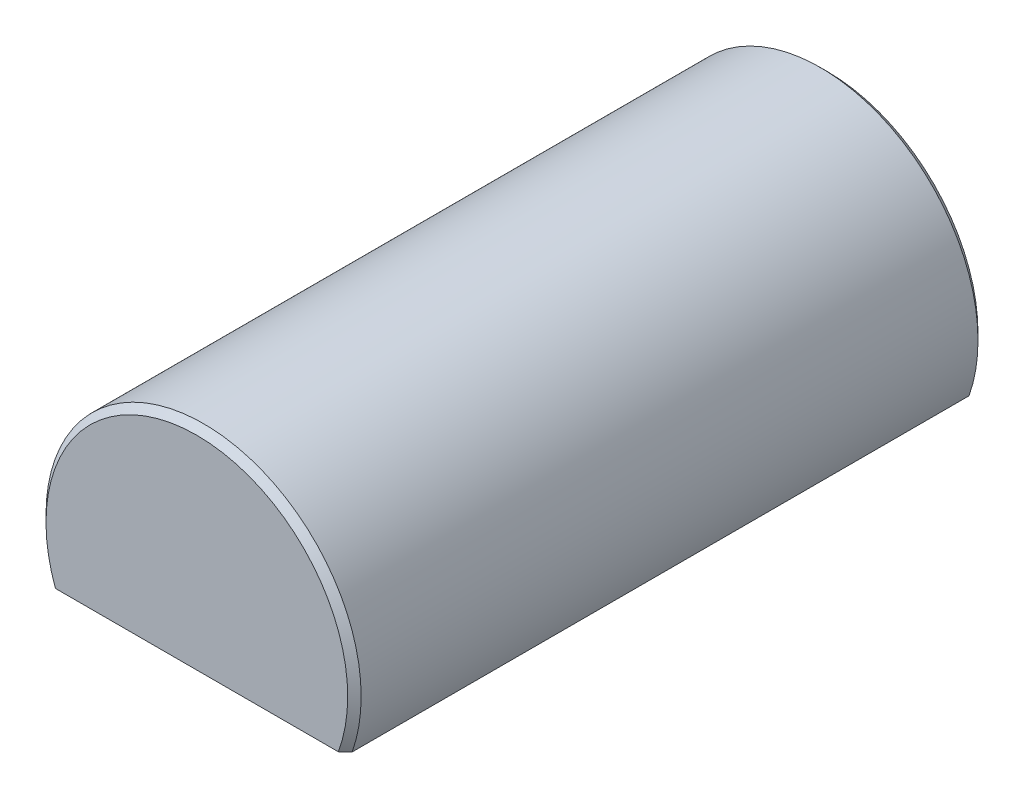
ISO-10303-21;
HEADER;
FILE_DESCRIPTION(('STEP AP214'),'2;1');
FILE_NAME('part.step','',(''),(''),'','','');
FILE_SCHEMA(('AUTOMOTIVE_DESIGN { 1 0 10303 214 1 1 1 1 }'));
ENDSEC;
DATA;
#1=APPLICATION_CONTEXT('core data for automotive mechanical design processes');
#2=APPLICATION_PROTOCOL_DEFINITION('international standard','automotive_design',2000,#1);
#3=PRODUCT_CONTEXT('',#1,'mechanical');
#4=PRODUCT('Part','Part','',(#3));
#5=PRODUCT_RELATED_PRODUCT_CATEGORY('part','',(#4));
#6=PRODUCT_DEFINITION_FORMATION('','',#4);
#7=PRODUCT_DEFINITION_CONTEXT('part definition',#1,'design');
#8=PRODUCT_DEFINITION('design','',#6,#7);
#9=PRODUCT_DEFINITION_SHAPE('','',#8);
#10=(LENGTH_UNIT() NAMED_UNIT(*) SI_UNIT(.MILLI.,.METRE.));
#11=(NAMED_UNIT(*) PLANE_ANGLE_UNIT() SI_UNIT($,.RADIAN.));
#12=(NAMED_UNIT(*) SI_UNIT($,.STERADIAN.) SOLID_ANGLE_UNIT());
#13=UNCERTAINTY_MEASURE_WITH_UNIT(LENGTH_MEASURE(1.E-05),#10,'distance_accuracy_value','');
#14=(GEOMETRIC_REPRESENTATION_CONTEXT(3) GLOBAL_UNCERTAINTY_ASSIGNED_CONTEXT((#13)) GLOBAL_UNIT_ASSIGNED_CONTEXT((#10,
#11,#12)) REPRESENTATION_CONTEXT('',''));
#15=CARTESIAN_POINT('',(0.,0.,0.));
#16=DIRECTION('',(0.,0.,1.));
#17=DIRECTION('',(1.,0.,0.));
#18=AXIS2_PLACEMENT_3D('',#15,#16,#17);
#19=CARTESIAN_POINT('',(0.,0.,19.05));
#20=DIRECTION('',(0.,0.,-1.));
#21=DIRECTION('',(-1.,0.,0.));
#22=AXIS2_PLACEMENT_3D('',#19,#20,#21);
#23=CYLINDRICAL_SURFACE('',#22,9.525);
#24=CARTESIAN_POINT('',(0.,0.,18.6436));
#25=DIRECTION('',(0.,0.,1.));
#26=DIRECTION('',(1.,0.,0.));
#27=AXIS2_PLACEMENT_3D('',#24,#25,#26);
#28=CIRCLE('',#27,9.525);
#29=CARTESIAN_POINT('',(-8.98025612106915,-3.175,18.6436));
#30=VERTEX_POINT('',#29);
#31=CARTESIAN_POINT('',(8.98025612106915,-3.175,18.6436));
#32=VERTEX_POINT('',#31);
#33=EDGE_CURVE('E106',#30,#32,#28,.F.);
#34=ORIENTED_EDGE('',*,*,#33,.T.);
#35=DIRECTION('',(0.,0.,1.));
#36=VECTOR('',#35,1.);
#37=CARTESIAN_POINT('',(8.98025612106915,-3.175,-19.05));
#38=LINE('',#37,#36);
#39=CARTESIAN_POINT('',(8.98025612106915,-3.175,-18.6435999999999));
#40=VERTEX_POINT('',#39);
#41=EDGE_CURVE('E88',#40,#32,#38,.T.);
#42=ORIENTED_EDGE('',*,*,#41,.F.);
#43=CARTESIAN_POINT('',(0.,0.,-18.6435999999999));
#44=DIRECTION('',(0.,0.,1.));
#45=DIRECTION('',(1.,0.,0.));
#46=AXIS2_PLACEMENT_3D('',#43,#44,#45);
#47=CIRCLE('',#46,9.525);
#48=CARTESIAN_POINT('',(-8.98025612106915,-3.175,-18.6435999999999));
#49=VERTEX_POINT('',#48);
#50=EDGE_CURVE('E101',#40,#49,#47,.T.);
#51=ORIENTED_EDGE('',*,*,#50,.T.);
#52=DIRECTION('',(0.,0.,1.));
#53=VECTOR('',#52,1.);
#54=CARTESIAN_POINT('',(-8.98025612106915,-3.175,-19.05));
#55=LINE('',#54,#53);
#56=EDGE_CURVE('E113',#49,#30,#55,.T.);
#57=ORIENTED_EDGE('',*,*,#56,.T.);
#58=EDGE_LOOP('',(#34,#42,#51,#57));
#59=FACE_BOUND('',#58,.T.);
#60=ADVANCED_FACE('F44',(#59),#23,.T.);
#61=CARTESIAN_POINT('',(0.,0.,19.05));
#62=DIRECTION('',(0.,0.,1.));
#63=DIRECTION('',(1.,0.,0.));
#64=AXIS2_PLACEMENT_3D('',#61,#62,#63);
#65=PLANE('',#64);
#66=DIRECTION('',(-1.,0.,0.));
#67=VECTOR('',#66,1.);
#68=CARTESIAN_POINT('',(-8.98025612106915,-3.175,19.05));
#69=LINE('',#68,#67);
#70=CARTESIAN_POINT('',(8.54799631258698,-3.175,19.05));
#71=VERTEX_POINT('',#70);
#72=CARTESIAN_POINT('',(-8.54799631258698,-3.175,19.05));
#73=VERTEX_POINT('',#72);
#74=EDGE_CURVE('E63',#71,#73,#69,.T.);
#75=ORIENTED_EDGE('',*,*,#74,.F.);
#76=CARTESIAN_POINT('',(0.,0.,19.05));
#77=DIRECTION('',(0.,0.,1.));
#78=DIRECTION('',(1.,0.,0.));
#79=AXIS2_PLACEMENT_3D('',#76,#77,#78);
#80=CIRCLE('',#79,9.11860000000003);
#81=EDGE_CURVE('E96',#71,#73,#80,.T.);
#82=ORIENTED_EDGE('',*,*,#81,.T.);
#83=EDGE_LOOP('',(#75,#82));
#84=FACE_BOUND('',#83,.T.);
#85=ADVANCED_FACE('F95',(#84),#65,.T.);
#86=CARTESIAN_POINT('',(0.,0.,-19.05));
#87=DIRECTION('',(0.,0.,1.));
#88=DIRECTION('',(1.,0.,0.));
#89=AXIS2_PLACEMENT_3D('',#86,#87,#88);
#90=PLANE('',#89);
#91=CARTESIAN_POINT('',(0.,0.,-19.05));
#92=DIRECTION('',(0.,0.,1.));
#93=DIRECTION('',(1.,0.,0.));
#94=AXIS2_PLACEMENT_3D('',#91,#92,#93);
#95=CIRCLE('',#94,9.11859999999995);
#96=CARTESIAN_POINT('',(-8.54799631258689,-3.175,-19.05));
#97=VERTEX_POINT('',#96);
#98=CARTESIAN_POINT('',(8.54799631258689,-3.175,-19.05));
#99=VERTEX_POINT('',#98);
#100=EDGE_CURVE('E99',#97,#99,#95,.F.);
#101=ORIENTED_EDGE('',*,*,#100,.T.);
#102=DIRECTION('',(-1.,0.,0.));
#103=VECTOR('',#102,1.);
#104=CARTESIAN_POINT('',(-8.98025612106915,-3.175,-19.05));
#105=LINE('',#104,#103);
#106=EDGE_CURVE('E97',#99,#97,#105,.T.);
#107=ORIENTED_EDGE('',*,*,#106,.T.);
#108=EDGE_LOOP('',(#101,#107));
#109=FACE_BOUND('',#108,.T.);
#110=ADVANCED_FACE('F124',(#109),#90,.F.);
#111=CARTESIAN_POINT('',(0.,0.,-18.6435999999999));
#112=DIRECTION('',(0.,0.,1.));
#113=DIRECTION('',(1.,0.,0.));
#114=AXIS2_PLACEMENT_3D('',#111,#112,#113);
#115=CONICAL_SURFACE('',#114,9.525,0.78539816339744);
#116=CARTESIAN_POINT('',(-19.7595218480049,-3.175,-8.15562099481962));
#117=CARTESIAN_POINT('',(-19.1925140216925,-3.175,-8.7154183397015));
#118=CARTESIAN_POINT('',(-18.6252305331766,-3.175,-9.27493723010743));
#119=CARTESIAN_POINT('',(-17.4894657452954,-3.175,-10.3935596725078));
#120=CARTESIAN_POINT('',(-16.9209838832793,-3.175,-10.9526626531448));
#121=CARTESIAN_POINT('',(-15.7755741167121,-3.175,-12.0770696474654));
#122=CARTESIAN_POINT('',(-15.1986325304485,-3.175,-12.6423597290652));
#123=CARTESIAN_POINT('',(-14.0436688072204,-3.175,-13.7710255464829));
#124=CARTESIAN_POINT('',(-13.4656477108254,-3.175,-14.3344023462319));
#125=CARTESIAN_POINT('',(-12.4705159540612,-3.175,-15.3006344002603));
#126=CARTESIAN_POINT('',(-12.0539233816909,-3.175,-15.7040230509635));
#127=CARTESIAN_POINT('',(-11.219222220886,-3.175,-16.5092923897319));
#128=CARTESIAN_POINT('',(-10.8011135222039,-3.175,-16.9111729636285));
#129=CARTESIAN_POINT('',(-9.9618043890059,-3.175,-17.7137894720876));
#130=CARTESIAN_POINT('',(-9.54059885127725,-3.175,-18.1145200738019));
#131=CARTESIAN_POINT('',(-8.69536369274984,-3.175,-18.9127645983045));
#132=CARTESIAN_POINT('',(-8.27133489125373,-3.175,-19.3102793859794));
#133=CARTESIAN_POINT('',(-7.6341707298214,-3.175,-19.9008908184188));
#134=CARTESIAN_POINT('',(-7.42271751985765,-3.175,-20.0958012630927));
#135=CARTESIAN_POINT('',(-6.9984306447158,-3.175,-20.484114250534));
#136=CARTESIAN_POINT('',(-6.78559698276183,-3.175,-20.6775167968209));
#137=CARTESIAN_POINT('',(-6.35793966377378,-3.175,-21.0625925503336));
#138=CARTESIAN_POINT('',(-6.14311406353169,-3.175,-21.254263604613));
#139=CARTESIAN_POINT('',(-5.81916935713243,-3.175,-21.5398164840543));
#140=CARTESIAN_POINT('',(-5.71090790489853,-3.175,-21.6346712877901));
#141=CARTESIAN_POINT('',(-5.49371873101143,-3.175,-21.8236251078582));
#142=CARTESIAN_POINT('',(-5.38479097918381,-3.175,-21.9177240895089));
#143=CARTESIAN_POINT('',(-5.05787462655519,-3.175,-22.197831488485));
#144=CARTESIAN_POINT('',(-4.83875951405758,-3.175,-22.3825297757046));
#145=CARTESIAN_POINT('',(-4.39646847568308,-3.175,-22.7469971377807));
#146=CARTESIAN_POINT('',(-4.17329291837068,-3.175,-22.9267666563422));
#147=CARTESIAN_POINT('',(-3.83443703007303,-3.175,-23.1907907398475));
#148=CARTESIAN_POINT('',(-3.72089777113942,-3.175,-23.2777913468337));
#149=CARTESIAN_POINT('',(-3.49211368943676,-3.175,-23.4495161287082));
#150=CARTESIAN_POINT('',(-3.37686895479638,-3.175,-23.5342404205902));
#151=CARTESIAN_POINT('',(-3.14439364175478,-3.175,-23.7007968775851));
#152=CARTESIAN_POINT('',(-3.02716412294902,-3.175,-23.7826305180934));
#153=CARTESIAN_POINT('',(-2.79025811492881,-3.175,-23.9426648438419));
#154=CARTESIAN_POINT('',(-2.67058203505152,-3.175,-24.0208661297667));
#155=CARTESIAN_POINT('',(-2.5205246375012,-3.175,-24.1148160231544));
#156=CARTESIAN_POINT('',(-2.49152725675288,-3.175,-24.132784639231));
#157=CARTESIAN_POINT('',(-2.43335482916836,-3.175,-24.1684360452421));
#158=CARTESIAN_POINT('',(-2.4041797718255,-3.175,-24.1861188180433));
#159=CARTESIAN_POINT('',(-2.31637282554547,-3.175,-24.2387132160758));
#160=CARTESIAN_POINT('',(-2.25746552490126,-3.175,-24.2731669271138));
#161=CARTESIAN_POINT('',(-2.13884991633875,-3.175,-24.3406860355773));
#162=CARTESIAN_POINT('',(-2.07914152230363,-3.175,-24.3737512821406));
#163=CARTESIAN_POINT('',(-1.9588719702749,-3.175,-24.4382873931208));
#164=CARTESIAN_POINT('',(-1.89831082667793,-3.175,-24.4697582844134));
#165=CARTESIAN_POINT('',(-1.71626949487602,-3.175,-24.5609395675323));
#166=CARTESIAN_POINT('',(-1.59343488727859,-3.175,-24.6179939551702));
#167=CARTESIAN_POINT('',(-1.3438126804564,-3.175,-24.7227838688997));
#168=CARTESIAN_POINT('',(-1.21702599819509,-3.175,-24.7705215382718));
#169=CARTESIAN_POINT('',(-0.996141655492472,-3.175,-24.8421407238446));
#170=CARTESIAN_POINT('',(-0.902996312538626,-3.175,-24.8689462359184));
#171=CARTESIAN_POINT('',(-0.714930875138836,-3.175,-24.9153774201318));
#172=CARTESIAN_POINT('',(-0.620011232133171,-3.175,-24.9350048931528));
#173=CARTESIAN_POINT('',(-0.42911382030481,-3.175,-24.9661121942424));
#174=CARTESIAN_POINT('',(-0.333139985715287,-3.175,-24.977615821125));
#175=CARTESIAN_POINT('',(-0.140535175388068,-3.175,-24.9919419026325));
#176=CARTESIAN_POINT('',(-0.0439041966456798,-3.175,-24.9947643175371));
#177=CARTESIAN_POINT('',(0.149406571525449,-3.175,-24.9915593092298));
#178=CARTESIAN_POINT('',(0.246086055980323,-3.175,-24.9855137589473));
#179=CARTESIAN_POINT('',(0.438519900949471,-3.175,-24.9648885054498));
#180=CARTESIAN_POINT('',(0.53427421044188,-3.175,-24.9503083342644));
#181=CARTESIAN_POINT('',(0.724543171122316,-3.175,-24.9133206989413));
#182=CARTESIAN_POINT('',(0.819053137345877,-3.175,-24.8908894409842));
#183=CARTESIAN_POINT('',(1.00615993219382,-3.175,-24.8392005441938));
#184=CARTESIAN_POINT('',(1.09875665211947,-3.175,-24.8099425186606));
#185=CARTESIAN_POINT('',(1.39914147587951,-3.175,-24.7045133797524));
#186=CARTESIAN_POINT('',(1.6027024230678,-3.175,-24.6162210584716));
#187=CARTESIAN_POINT('',(1.90064382775067,-3.175,-24.4691905488746));
#188=CARTESIAN_POINT('',(1.99883579493961,-3.175,-24.4176789268812));
#189=CARTESIAN_POINT('',(2.19303970560455,-3.175,-24.3106893484931));
#190=CARTESIAN_POINT('',(2.28905201231669,-3.175,-24.2552120594577));
#191=CARTESIAN_POINT('',(2.47989531280301,-3.175,-24.1406178908478));
#192=CARTESIAN_POINT('',(2.57471092780789,-3.175,-24.0814756653364));
#193=CARTESIAN_POINT('',(2.76264452192855,-3.175,-23.9605532577096));
#194=CARTESIAN_POINT('',(2.85576245952446,-3.175,-23.8987730111996));
#195=CARTESIAN_POINT('',(3.04042937935504,-3.175,-23.7731180965309));
#196=CARTESIAN_POINT('',(3.13197987484892,-3.175,-23.7092456447566));
#197=CARTESIAN_POINT('',(3.31380176333063,-3.175,-23.5797169068745));
#198=CARTESIAN_POINT('',(3.40407320172083,-3.175,-23.5140606843274));
#199=CARTESIAN_POINT('',(3.69141418520648,-3.175,-23.3014229643417));
#200=CARTESIAN_POINT('',(3.88637292900471,-3.175,-23.1515888401811));
#201=CARTESIAN_POINT('',(4.27238325951992,-3.175,-22.8469554180239));
#202=CARTESIAN_POINT('',(4.46343425596424,-3.175,-22.6921553788551));
#203=CARTESIAN_POINT('',(4.84265690045891,-3.175,-22.3789080776494));
#204=CARTESIAN_POINT('',(5.03082724140755,-3.175,-22.2204592371163));
#205=CARTESIAN_POINT('',(5.40489471047075,-3.175,-21.9008988903217));
#206=CARTESIAN_POINT('',(5.59079177946445,-3.175,-21.7397873150656));
#207=CARTESIAN_POINT('',(5.9611060216685,-3.175,-21.4152716298887));
#208=CARTESIAN_POINT('',(6.14552029598192,-3.175,-21.2518642173342));
#209=CARTESIAN_POINT('',(6.51292767139622,-3.175,-20.9234572016542));
#210=CARTESIAN_POINT('',(6.69592075452822,-3.175,-20.7584575784565));
#211=CARTESIAN_POINT('',(7.24309250324754,-3.175,-20.2616736907033));
#212=CARTESIAN_POINT('',(7.60556693203461,-3.175,-19.9280132070994));
#213=CARTESIAN_POINT('',(8.32608488808894,-3.175,-19.2586757710049));
#214=CARTESIAN_POINT('',(8.68413999682714,-3.175,-18.9230112401014));
#215=CARTESIAN_POINT('',(9.3981109686734,-3.175,-18.2493694292496));
#216=CARTESIAN_POINT('',(9.75402668851572,-3.175,-17.9113919975869));
#217=CARTESIAN_POINT('',(10.4639630698512,-3.175,-17.2340735330518));
#218=CARTESIAN_POINT('',(10.817985114693,-3.175,-16.8947339485177));
#219=CARTESIAN_POINT('',(11.524832529469,-3.175,-16.2148101155029));
#220=CARTESIAN_POINT('',(11.8776578971255,-3.175,-15.8742258646555));
#221=CARTESIAN_POINT('',(12.8608487771356,-3.175,-14.9225911287926));
#222=CARTESIAN_POINT('',(13.4902037219092,-3.175,-14.3104968974133));
#223=CARTESIAN_POINT('',(14.7471510999701,-3.175,-13.0841616232175));
#224=CARTESIAN_POINT('',(15.374743005935,-3.175,-12.4699200405845));
#225=CARTESIAN_POINT('',(16.6291765559095,-3.175,-11.2394794340118));
#226=CARTESIAN_POINT('',(17.2560169180584,-3.175,-10.6232791037551));
#227=CARTESIAN_POINT('',(18.5085205845555,-3.175,-9.39003560907936));
#228=CARTESIAN_POINT('',(19.1341841706568,-3.175,-8.77299273086803));
#229=CARTESIAN_POINT('',(19.7595218480049,-3.175,-8.15562099481962));
#230=B_SPLINE_CURVE_WITH_KNOTS('',3,(#116,#117,#118,#119,#120,#121,#122,#123,#124,#125,#126,
#127,#128,#129,#130,#131,#132,#133,#134,#135,#136,#137,#138,#139,#140,#141,#142,#143,#144,#145,
#146,#147,#148,#149,#150,#151,#152,#153,#154,#155,#156,#157,#158,#159,#160,#161,#162,#163,#164,
#165,#166,#167,#168,#169,#170,#171,#172,#173,#174,#175,#176,#177,#178,#179,#180,#181,#182,#183,
#184,#185,#186,#187,#188,#189,#190,#191,#192,#193,#194,#195,#196,#197,#198,#199,#200,#201,#202,
#203,#204,#205,#206,#207,#208,#209,#210,#211,#212,#213,#214,#215,#216,#217,#218,#219,#220,#221,
#222,#223,#224,#225,#226,#227,#228,#229),.UNSPECIFIED.,.F.,.F.,(4,2,2,2,2,2,2,2,2,2,2,2,2,2,2,2,
2,2,2,2,2,2,2,2,2,2,2,2,2,2,2,2,2,2,2,2,2,2,2,2,2,2,2,2,2,2,2,2,2,2,2,2,2,2,2,2,4),(0.,
2.3903643929124,4.78241488355248,7.20557841157216,9.62704382276202,11.366709508341,
13.1065043401576,14.8506262801505,16.5942624104021,17.4569983331602,18.3197322416802,
19.1834218216943,19.6152309894401,20.0470598592952,20.9067378044764,21.7663381026297,
22.1954349501858,22.6245097015057,23.0533621909907,23.48214350654,23.5844822858615,
23.6868271767688,23.8915394907818,24.096273990368,24.3010050376335,24.7070199187601,
25.1129412871096,25.4034789534971,25.6939436774803,25.9835539148037,26.2731654772177,
26.5633698622612,26.8535901612796,27.144697740264,27.4358218129422,28.0994930845437,
28.4321147937085,28.7646806590594,29.0998804786146,29.4350884851404,29.7699521950312,
30.104803988422,30.8423225325694,31.5799516696313,32.3179061382373,33.0558797581443,
33.7950537117306,34.5342369959243,36.0121902906521,37.48454655307,38.9570003383379,
40.4281684211866,41.8993393027234,44.5330975472239,47.16757387181,49.8045566225282,
52.4407967951233),.UNSPECIFIED.);
#231=EDGE_CURVE('E70',#49,#97,#230,.T.);
#232=ORIENTED_EDGE('',*,*,#231,.F.);
#233=ORIENTED_EDGE('',*,*,#50,.F.);
#234=EDGE_CURVE('E108',#99,#40,#230,.T.);
#235=ORIENTED_EDGE('',*,*,#234,.F.);
#236=ORIENTED_EDGE('',*,*,#100,.F.);
#237=EDGE_LOOP('',(#232,#233,#235,#236));
#238=FACE_BOUND('',#237,.T.);
#239=ADVANCED_FACE('F115',(#238),#115,.T.);
#240=CARTESIAN_POINT('',(0.,0.,19.05));
#241=DIRECTION('',(0.,0.,-1.));
#242=DIRECTION('',(-1.,0.,0.));
#243=AXIS2_PLACEMENT_3D('',#240,#241,#242);
#244=CONICAL_SURFACE('',#243,9.11860000000003,0.785398163397448);
#245=CARTESIAN_POINT('',(19.7595218480049,-3.175,8.15562099481988));
#246=CARTESIAN_POINT('',(19.1925140216925,-3.175,8.71541833970175));
#247=CARTESIAN_POINT('',(18.6252305331766,-3.175,9.27493723010766));
#248=CARTESIAN_POINT('',(17.4894657452954,-3.175,10.393559672508));
#249=CARTESIAN_POINT('',(16.9209838832793,-3.175,10.952662653145));
#250=CARTESIAN_POINT('',(15.7755741167121,-3.175,12.0770696474656));
#251=CARTESIAN_POINT('',(15.1986325304485,-3.175,12.6423597290654));
#252=CARTESIAN_POINT('',(14.0436688072204,-3.175,13.771025546483));
#253=CARTESIAN_POINT('',(13.4656477108255,-3.175,14.3344023462319));
#254=CARTESIAN_POINT('',(12.4705159540613,-3.175,15.3006344002603));
#255=CARTESIAN_POINT('',(12.053923381691,-3.175,15.7040230509636));
#256=CARTESIAN_POINT('',(11.219222220886,-3.175,16.509292389732));
#257=CARTESIAN_POINT('',(10.8011135222039,-3.175,16.9111729636286));
#258=CARTESIAN_POINT('',(9.96180438900592,-3.175,17.7137894720877));
#259=CARTESIAN_POINT('',(9.54059885127728,-3.175,18.114520073802));
#260=CARTESIAN_POINT('',(8.69536369274985,-3.175,18.9127645983046));
#261=CARTESIAN_POINT('',(8.27133489125373,-3.175,19.3102793859795));
#262=CARTESIAN_POINT('',(7.63417072982139,-3.175,19.9008908184189));
#263=CARTESIAN_POINT('',(7.42271751985763,-3.175,20.0958012630928));
#264=CARTESIAN_POINT('',(6.99843064471578,-3.175,20.4841142505341));
#265=CARTESIAN_POINT('',(6.7855969827618,-3.175,20.6775167968209));
#266=CARTESIAN_POINT('',(6.35793966377375,-3.175,21.0625925503337));
#267=CARTESIAN_POINT('',(6.14311406353165,-3.175,21.2542636046131));
#268=CARTESIAN_POINT('',(5.81916935713239,-3.175,21.5398164840544));
#269=CARTESIAN_POINT('',(5.71090790489848,-3.175,21.6346712877901));
#270=CARTESIAN_POINT('',(5.49371873101138,-3.175,21.8236251078583));
#271=CARTESIAN_POINT('',(5.38479097918376,-3.175,21.917724089509));
#272=CARTESIAN_POINT('',(5.05787462655514,-3.175,22.1978314884851));
#273=CARTESIAN_POINT('',(4.83875951405753,-3.175,22.3825297757047));
#274=CARTESIAN_POINT('',(4.39646847568302,-3.175,22.7469971377808));
#275=CARTESIAN_POINT('',(4.17329291837062,-3.175,22.9267666563422));
#276=CARTESIAN_POINT('',(3.83443703007296,-3.175,23.1907907398476));
#277=CARTESIAN_POINT('',(3.72089777113935,-3.175,23.2777913468337));
#278=CARTESIAN_POINT('',(3.49211368943669,-3.175,23.4495161287083));
#279=CARTESIAN_POINT('',(3.3768689547963,-3.175,23.5342404205903));
#280=CARTESIAN_POINT('',(3.14439364175469,-3.175,23.7007968775851));
#281=CARTESIAN_POINT('',(3.02716412294894,-3.175,23.7826305180934));
#282=CARTESIAN_POINT('',(2.79025811492872,-3.175,23.942664843842));
#283=CARTESIAN_POINT('',(2.67058203505143,-3.175,24.0208661297668));
#284=CARTESIAN_POINT('',(2.52052463750111,-3.175,24.1148160231545));
#285=CARTESIAN_POINT('',(2.49152725675279,-3.175,24.132784639231));
#286=CARTESIAN_POINT('',(2.43335482916827,-3.175,24.1684360452421));
#287=CARTESIAN_POINT('',(2.40417977182542,-3.175,24.1861188180434));
#288=CARTESIAN_POINT('',(2.31637282554538,-3.175,24.2387132160758));
#289=CARTESIAN_POINT('',(2.25746552490117,-3.175,24.2731669271138));
#290=CARTESIAN_POINT('',(2.13884991633866,-3.175,24.3406860355773));
#291=CARTESIAN_POINT('',(2.07914152230355,-3.175,24.3737512821406));
#292=CARTESIAN_POINT('',(1.95887197027482,-3.175,24.4382873931208));
#293=CARTESIAN_POINT('',(1.89831082667786,-3.175,24.4697582844134));
#294=CARTESIAN_POINT('',(1.71626949487595,-3.175,24.5609395675323));
#295=CARTESIAN_POINT('',(1.59343488727852,-3.175,24.6179939551702));
#296=CARTESIAN_POINT('',(1.34381268045635,-3.175,24.7227838688997));
#297=CARTESIAN_POINT('',(1.21702599819504,-3.175,24.7705215382718));
#298=CARTESIAN_POINT('',(0.996141655492421,-3.175,24.8421407238446));
#299=CARTESIAN_POINT('',(0.902996312538573,-3.175,24.8689462359184));
#300=CARTESIAN_POINT('',(0.714930875138781,-3.175,24.9153774201318));
#301=CARTESIAN_POINT('',(0.620011232133115,-3.175,24.9350048931528));
#302=CARTESIAN_POINT('',(0.429113820304751,-3.175,24.9661121942424));
#303=CARTESIAN_POINT('',(0.333139985715226,-3.175,24.977615821125));
#304=CARTESIAN_POINT('',(0.140535175388004,-3.175,24.9919419026325));
#305=CARTESIAN_POINT('',(0.043904196645615,-3.175,24.9947643175371));
#306=CARTESIAN_POINT('',(-0.149406571525516,-3.175,24.9915593092298));
#307=CARTESIAN_POINT('',(-0.246086055980391,-3.175,24.9855137589473));
#308=CARTESIAN_POINT('',(-0.43851990094954,-3.175,24.9648885054497));
#309=CARTESIAN_POINT('',(-0.534274210441948,-3.175,24.9503083342644));
#310=CARTESIAN_POINT('',(-0.724543171122384,-3.175,24.9133206989412));
#311=CARTESIAN_POINT('',(-0.819053137345944,-3.175,24.8908894409841));
#312=CARTESIAN_POINT('',(-1.00615993219389,-3.175,24.8392005441938));
#313=CARTESIAN_POINT('',(-1.09875665211954,-3.175,24.8099425186606));
#314=CARTESIAN_POINT('',(-1.3991414758796,-3.175,24.7045133797523));
#315=CARTESIAN_POINT('',(-1.60270242306791,-3.175,24.6162210584715));
#316=CARTESIAN_POINT('',(-1.90064382775079,-3.175,24.4691905488745));
#317=CARTESIAN_POINT('',(-1.99883579493975,-3.175,24.4176789268811));
#318=CARTESIAN_POINT('',(-2.1930397056047,-3.175,24.310689348493));
#319=CARTESIAN_POINT('',(-2.28905201231684,-3.175,24.2552120594576));
#320=CARTESIAN_POINT('',(-2.47989531280318,-3.175,24.1406178908476));
#321=CARTESIAN_POINT('',(-2.57471092780807,-3.175,24.0814756653363));
#322=CARTESIAN_POINT('',(-2.76264452192875,-3.175,23.9605532577095));
#323=CARTESIAN_POINT('',(-2.85576245952466,-3.175,23.8987730111995));
#324=CARTESIAN_POINT('',(-3.04042937935526,-3.175,23.7731180965308));
#325=CARTESIAN_POINT('',(-3.13197987484914,-3.175,23.7092456447565));
#326=CARTESIAN_POINT('',(-3.31380176333086,-3.175,23.5797169068744));
#327=CARTESIAN_POINT('',(-3.40407320172106,-3.175,23.5140606843272));
#328=CARTESIAN_POINT('',(-3.69141418520674,-3.175,23.3014229643415));
#329=CARTESIAN_POINT('',(-3.88637292900498,-3.175,23.1515888401809));
#330=CARTESIAN_POINT('',(-4.27238325952023,-3.175,22.8469554180237));
#331=CARTESIAN_POINT('',(-4.46343425596457,-3.175,22.6921553788548));
#332=CARTESIAN_POINT('',(-4.84265690045928,-3.175,22.3789080776491));
#333=CARTESIAN_POINT('',(-5.03082724140793,-3.175,22.220459237116));
#334=CARTESIAN_POINT('',(-5.40489471047117,-3.175,21.9008988903213));
#335=CARTESIAN_POINT('',(-5.59079177946488,-3.175,21.7397873150653));
#336=CARTESIAN_POINT('',(-5.96110602166897,-3.175,21.4152716298883));
#337=CARTESIAN_POINT('',(-6.14552029598241,-3.175,21.2518642173338));
#338=CARTESIAN_POINT('',(-6.51292767139675,-3.175,20.9234572016538));
#339=CARTESIAN_POINT('',(-6.69592075452877,-3.175,20.758457578456));
#340=CARTESIAN_POINT('',(-7.24309250324813,-3.175,20.2616736907028));
#341=CARTESIAN_POINT('',(-7.60556693203524,-3.175,19.9280132070989));
#342=CARTESIAN_POINT('',(-8.32608488808964,-3.175,19.2586757710043));
#343=CARTESIAN_POINT('',(-8.68413999682788,-3.175,18.9230112401008));
#344=CARTESIAN_POINT('',(-9.3981109686742,-3.175,18.2493694292489));
#345=CARTESIAN_POINT('',(-9.75402668851656,-3.175,17.9113919975862));
#346=CARTESIAN_POINT('',(-10.4639630698521,-3.175,17.234073533051));
#347=CARTESIAN_POINT('',(-10.8179851146939,-3.175,16.8947339485169));
#348=CARTESIAN_POINT('',(-11.5248325294701,-3.175,16.214810115502));
#349=CARTESIAN_POINT('',(-11.8776578971265,-3.175,15.8742258646547));
#350=CARTESIAN_POINT('',(-12.8608487771366,-3.175,14.9225911287918));
#351=CARTESIAN_POINT('',(-13.4902037219101,-3.175,14.3104968974126));
#352=CARTESIAN_POINT('',(-14.7471510999709,-3.175,13.084161623217));
#353=CARTESIAN_POINT('',(-15.3747430059356,-3.175,12.4699200405841));
#354=CARTESIAN_POINT('',(-16.62917655591,-3.175,11.2394794340116));
#355=CARTESIAN_POINT('',(-17.2560169180588,-3.175,10.6232791037549));
#356=CARTESIAN_POINT('',(-18.5085205845557,-3.175,9.39003560907942));
#357=CARTESIAN_POINT('',(-19.1341841706569,-3.175,8.77299273086819));
#358=CARTESIAN_POINT('',(-19.7595218480049,-3.175,8.15562099481988));
#359=B_SPLINE_CURVE_WITH_KNOTS('',3,(#245,#246,#247,#248,#249,#250,#251,#252,#253,#254,#255,
#256,#257,#258,#259,#260,#261,#262,#263,#264,#265,#266,#267,#268,#269,#270,#271,#272,#273,#274,
#275,#276,#277,#278,#279,#280,#281,#282,#283,#284,#285,#286,#287,#288,#289,#290,#291,#292,#293,
#294,#295,#296,#297,#298,#299,#300,#301,#302,#303,#304,#305,#306,#307,#308,#309,#310,#311,#312,
#313,#314,#315,#316,#317,#318,#319,#320,#321,#322,#323,#324,#325,#326,#327,#328,#329,#330,#331,
#332,#333,#334,#335,#336,#337,#338,#339,#340,#341,#342,#343,#344,#345,#346,#347,#348,#349,#350,
#351,#352,#353,#354,#355,#356,#357,#358),.UNSPECIFIED.,.F.,.F.,(4,2,2,2,2,2,2,2,2,2,2,2,2,2,2,2,
2,2,2,2,2,2,2,2,2,2,2,2,2,2,2,2,2,2,2,2,2,2,2,2,2,2,2,2,2,2,2,2,2,2,2,2,2,2,2,2,4),(0.,
2.39036439291235,4.78241488355238,7.20557841157202,9.62704382276184,11.3667095083409,
13.1065043401574,14.8506262801503,16.594262410402,17.4569983331601,18.3197322416801,
19.1834218216942,19.61523098944,20.0470598592951,20.9067378044763,21.7663381026296,
22.1954349501857,22.6245097015056,23.0533621909907,23.4821435065399,23.5844822858614,
23.6868271767687,23.8915394907817,24.0962739903679,24.3010050376334,24.70701991876,
25.1129412871095,25.403478953497,25.6939436774802,25.9835539148036,26.2731654772175,
26.5633698622611,26.8535901612795,27.1446977402639,27.4358218129421,28.0994930845436,
28.4321147937085,28.7646806590594,29.0998804786146,29.4350884851405,29.7699521950313,
30.1048039884221,30.8423225325696,31.5799516696315,32.3179061382376,33.0558797581447,
33.795053711731,34.5342369959248,36.0121902906528,37.4845465530708,38.9570003383388,
40.4281684211877,41.8993393027247,44.5330975472248,47.1675738718105,49.8045566225282,
52.440796795123),.UNSPECIFIED.);
#360=EDGE_CURVE('E13',#32,#71,#359,.T.);
#361=ORIENTED_EDGE('',*,*,#360,.F.);
#362=ORIENTED_EDGE('',*,*,#33,.F.);
#363=EDGE_CURVE('E49',#73,#30,#359,.T.);
#364=ORIENTED_EDGE('',*,*,#363,.F.);
#365=ORIENTED_EDGE('',*,*,#81,.F.);
#366=EDGE_LOOP('',(#361,#362,#364,#365));
#367=FACE_BOUND('',#366,.T.);
#368=ADVANCED_FACE('F46',(#367),#244,.T.);
#369=CARTESIAN_POINT('',(-8.98025612106915,-3.175,-19.05));
#370=DIRECTION('',(0.,1.,0.));
#371=DIRECTION('',(0.,0.,1.));
#372=AXIS2_PLACEMENT_3D('',#369,#370,#371);
#373=PLANE('',#372);
#374=ORIENTED_EDGE('',*,*,#231,.T.);
#375=ORIENTED_EDGE('',*,*,#106,.F.);
#376=ORIENTED_EDGE('',*,*,#234,.T.);
#377=ORIENTED_EDGE('',*,*,#41,.T.);
#378=ORIENTED_EDGE('',*,*,#360,.T.);
#379=ORIENTED_EDGE('',*,*,#74,.T.);
#380=ORIENTED_EDGE('',*,*,#363,.T.);
#381=ORIENTED_EDGE('',*,*,#56,.F.);
#382=EDGE_LOOP('',(#374,#375,#376,#377,#378,#379,#380,#381));
#383=FACE_BOUND('',#382,.T.);
#384=ADVANCED_FACE('F86',(#383),#373,.F.);
#385=CLOSED_SHELL('',(#60,#85,#110,#239,#368,#384));
#386=MANIFOLD_SOLID_BREP('B2',#385);
#387=ADVANCED_BREP_SHAPE_REPRESENTATION('',(#18,#386),#14);
#388=SHAPE_DEFINITION_REPRESENTATION(#9,#387);
ENDSEC;
END-ISO-10303-21;
